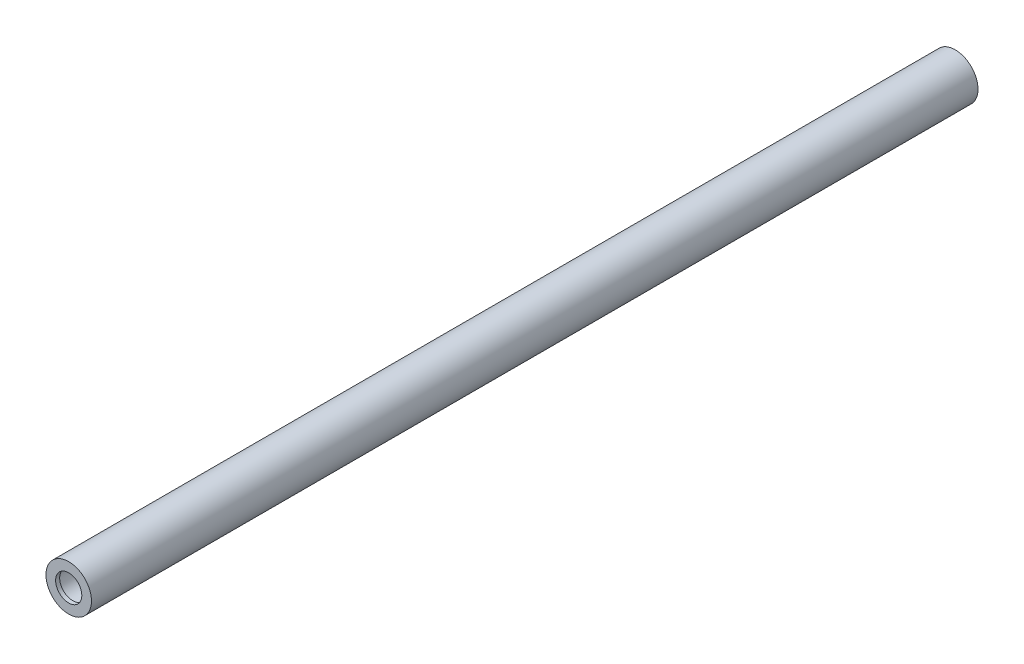
ISO-10303-21;
HEADER;
FILE_DESCRIPTION(('STEP AP214'),'2;1');
FILE_NAME('part.step','',(''),(''),'','','');
FILE_SCHEMA(('AUTOMOTIVE_DESIGN { 1 0 10303 214 1 1 1 1 }'));
ENDSEC;
DATA;
#1=APPLICATION_CONTEXT('core data for automotive mechanical design processes');
#2=APPLICATION_PROTOCOL_DEFINITION('international standard','automotive_design',2000,#1);
#3=PRODUCT_CONTEXT('',#1,'mechanical');
#4=PRODUCT('Part','Part','',(#3));
#5=PRODUCT_RELATED_PRODUCT_CATEGORY('part','',(#4));
#6=PRODUCT_DEFINITION_FORMATION('','',#4);
#7=PRODUCT_DEFINITION_CONTEXT('part definition',#1,'design');
#8=PRODUCT_DEFINITION('design','',#6,#7);
#9=PRODUCT_DEFINITION_SHAPE('','',#8);
#10=(LENGTH_UNIT() NAMED_UNIT(*) SI_UNIT(.MILLI.,.METRE.));
#11=(NAMED_UNIT(*) PLANE_ANGLE_UNIT() SI_UNIT($,.RADIAN.));
#12=(NAMED_UNIT(*) SI_UNIT($,.STERADIAN.) SOLID_ANGLE_UNIT());
#13=UNCERTAINTY_MEASURE_WITH_UNIT(LENGTH_MEASURE(1.E-05),#10,'distance_accuracy_value','');
#14=(GEOMETRIC_REPRESENTATION_CONTEXT(3) GLOBAL_UNCERTAINTY_ASSIGNED_CONTEXT((#13)) GLOBAL_UNIT_ASSIGNED_CONTEXT((#10,
#11,#12)) REPRESENTATION_CONTEXT('',''));
#15=CARTESIAN_POINT('',(0.,0.,0.));
#16=DIRECTION('',(0.,0.,1.));
#17=DIRECTION('',(1.,0.,0.));
#18=AXIS2_PLACEMENT_3D('',#15,#16,#17);
#19=CARTESIAN_POINT('',(0.,0.,440.));
#20=DIRECTION('',(0.,0.,-1.));
#21=DIRECTION('',(-1.,0.,0.));
#22=AXIS2_PLACEMENT_3D('',#19,#20,#21);
#23=CYLINDRICAL_SURFACE('',#22,11.295);
#24=CARTESIAN_POINT('',(0.,0.,440.));
#25=DIRECTION('',(0.,0.,1.));
#26=DIRECTION('',(1.,0.,0.));
#27=AXIS2_PLACEMENT_3D('',#24,#25,#26);
#28=CIRCLE('',#27,11.295);
#29=CARTESIAN_POINT('',(11.295,0.,440.));
#30=VERTEX_POINT('',#29);
#31=EDGE_CURVE('E11',#30,#30,#28,.T.);
#32=ORIENTED_EDGE('',*,*,#31,.F.);
#33=EDGE_LOOP('',(#32));
#34=FACE_BOUND('',#33,.T.);
#35=CARTESIAN_POINT('',(0.,0.,0.));
#36=DIRECTION('',(0.,0.,1.));
#37=DIRECTION('',(1.,0.,0.));
#38=AXIS2_PLACEMENT_3D('',#35,#36,#37);
#39=CIRCLE('',#38,11.295);
#40=CARTESIAN_POINT('',(11.295,0.,0.));
#41=VERTEX_POINT('',#40);
#42=EDGE_CURVE('E43',#41,#41,#39,.T.);
#43=ORIENTED_EDGE('',*,*,#42,.T.);
#44=EDGE_LOOP('',(#43));
#45=FACE_BOUND('',#44,.T.);
#46=ADVANCED_FACE('F40',(#34,#45),#23,.T.);
#47=CARTESIAN_POINT('',(0.,0.,0.));
#48=DIRECTION('',(0.,0.,1.));
#49=DIRECTION('',(1.,0.,0.));
#50=AXIS2_PLACEMENT_3D('',#47,#48,#49);
#51=PLANE('',#50);
#52=CARTESIAN_POINT('',(0.,0.,0.));
#53=DIRECTION('',(0.,0.,-1.));
#54=DIRECTION('',(-1.,0.,0.));
#55=AXIS2_PLACEMENT_3D('',#52,#53,#54);
#56=CIRCLE('',#55,6.5);
#57=CARTESIAN_POINT('',(-6.5,0.,0.));
#58=VERTEX_POINT('',#57);
#59=EDGE_CURVE('E52',#58,#58,#56,.T.);
#60=ORIENTED_EDGE('',*,*,#59,.F.);
#61=EDGE_LOOP('',(#60));
#62=FACE_BOUND('',#61,.T.);
#63=ORIENTED_EDGE('',*,*,#42,.F.);
#64=EDGE_LOOP('',(#63));
#65=FACE_BOUND('',#64,.T.);
#66=ADVANCED_FACE('F104',(#62,#65),#51,.F.);
#67=CARTESIAN_POINT('',(0.,0.,440.));
#68=DIRECTION('',(0.,0.,1.));
#69=DIRECTION('',(1.,0.,0.));
#70=AXIS2_PLACEMENT_3D('',#67,#68,#69);
#71=PLANE('',#70);
#72=CARTESIAN_POINT('',(0.,0.,440.));
#73=DIRECTION('',(0.,0.,1.));
#74=DIRECTION('',(1.,0.,0.));
#75=AXIS2_PLACEMENT_3D('',#72,#73,#74);
#76=CIRCLE('',#75,6.5);
#77=CARTESIAN_POINT('',(6.5,0.,440.));
#78=VERTEX_POINT('',#77);
#79=EDGE_CURVE('E66',#78,#78,#76,.T.);
#80=ORIENTED_EDGE('',*,*,#79,.F.);
#81=EDGE_LOOP('',(#80));
#82=FACE_BOUND('',#81,.T.);
#83=ORIENTED_EDGE('',*,*,#31,.T.);
#84=EDGE_LOOP('',(#83));
#85=FACE_BOUND('',#84,.T.);
#86=ADVANCED_FACE('F109',(#82,#85),#71,.T.);
#87=CARTESIAN_POINT('',(0.,0.,2.));
#88=DIRECTION('',(0.,0.,-1.));
#89=DIRECTION('',(-1.,0.,0.));
#90=AXIS2_PLACEMENT_3D('',#87,#88,#89);
#91=CYLINDRICAL_SURFACE('',#90,6.5);
#92=CARTESIAN_POINT('',(0.,0.,2.));
#93=DIRECTION('',(0.,0.,-1.));
#94=DIRECTION('',(-1.,0.,0.));
#95=AXIS2_PLACEMENT_3D('',#92,#93,#94);
#96=CIRCLE('',#95,6.5);
#97=CARTESIAN_POINT('',(-6.5,0.,2.));
#98=VERTEX_POINT('',#97);
#99=EDGE_CURVE('E57',#98,#98,#96,.T.);
#100=ORIENTED_EDGE('',*,*,#99,.F.);
#101=EDGE_LOOP('',(#100));
#102=FACE_BOUND('',#101,.T.);
#103=ORIENTED_EDGE('',*,*,#59,.T.);
#104=EDGE_LOOP('',(#103));
#105=FACE_BOUND('',#104,.T.);
#106=ADVANCED_FACE('F117',(#102,#105),#91,.F.);
#107=CARTESIAN_POINT('',(0.,0.,17.));
#108=DIRECTION('',(0.,0.,-1.));
#109=DIRECTION('',(-1.,0.,0.));
#110=AXIS2_PLACEMENT_3D('',#107,#108,#109);
#111=CYLINDRICAL_SURFACE('',#110,7.5);
#112=CARTESIAN_POINT('',(0.,0.,17.));
#113=DIRECTION('',(0.,0.,-1.));
#114=DIRECTION('',(-1.,0.,0.));
#115=AXIS2_PLACEMENT_3D('',#112,#113,#114);
#116=CIRCLE('',#115,7.5);
#117=CARTESIAN_POINT('',(-7.5,0.,17.));
#118=VERTEX_POINT('',#117);
#119=EDGE_CURVE('E61',#118,#118,#116,.T.);
#120=ORIENTED_EDGE('',*,*,#119,.F.);
#121=EDGE_LOOP('',(#120));
#122=FACE_BOUND('',#121,.T.);
#123=CARTESIAN_POINT('',(0.,0.,2.));
#124=DIRECTION('',(0.,0.,-1.));
#125=DIRECTION('',(-1.,0.,0.));
#126=AXIS2_PLACEMENT_3D('',#123,#124,#125);
#127=CIRCLE('',#126,7.5);
#128=CARTESIAN_POINT('',(-7.5,0.,2.));
#129=VERTEX_POINT('',#128);
#130=EDGE_CURVE('E62',#129,#129,#127,.T.);
#131=ORIENTED_EDGE('',*,*,#130,.T.);
#132=EDGE_LOOP('',(#131));
#133=FACE_BOUND('',#132,.T.);
#134=ADVANCED_FACE('F124',(#122,#133),#111,.F.);
#135=CARTESIAN_POINT('',(0.,0.,17.));
#136=DIRECTION('',(0.,0.,-1.));
#137=DIRECTION('',(-1.,0.,0.));
#138=AXIS2_PLACEMENT_3D('',#135,#136,#137);
#139=PLANE('',#138);
#140=ORIENTED_EDGE('',*,*,#119,.T.);
#141=EDGE_LOOP('',(#140));
#142=FACE_BOUND('',#141,.T.);
#143=ADVANCED_FACE('F128',(#142),#139,.T.);
#144=CARTESIAN_POINT('',(0.,0.,2.));
#145=DIRECTION('',(0.,0.,-1.));
#146=DIRECTION('',(-1.,0.,0.));
#147=AXIS2_PLACEMENT_3D('',#144,#145,#146);
#148=PLANE('',#147);
#149=ORIENTED_EDGE('',*,*,#99,.T.);
#150=EDGE_LOOP('',(#149));
#151=FACE_BOUND('',#150,.T.);
#152=ORIENTED_EDGE('',*,*,#130,.F.);
#153=EDGE_LOOP('',(#152));
#154=FACE_BOUND('',#153,.T.);
#155=ADVANCED_FACE('F130',(#151,#154),#148,.F.);
#156=CARTESIAN_POINT('',(0.,0.,438.));
#157=DIRECTION('',(0.,0.,1.));
#158=DIRECTION('',(1.,0.,0.));
#159=AXIS2_PLACEMENT_3D('',#156,#157,#158);
#160=CYLINDRICAL_SURFACE('',#159,6.5);
#161=CARTESIAN_POINT('',(0.,0.,438.));
#162=DIRECTION('',(0.,0.,1.));
#163=DIRECTION('',(1.,0.,0.));
#164=AXIS2_PLACEMENT_3D('',#161,#162,#163);
#165=CIRCLE('',#164,6.5);
#166=CARTESIAN_POINT('',(6.5,0.,438.));
#167=VERTEX_POINT('',#166);
#168=EDGE_CURVE('E73',#167,#167,#165,.T.);
#169=ORIENTED_EDGE('',*,*,#168,.F.);
#170=EDGE_LOOP('',(#169));
#171=FACE_BOUND('',#170,.T.);
#172=ORIENTED_EDGE('',*,*,#79,.T.);
#173=EDGE_LOOP('',(#172));
#174=FACE_BOUND('',#173,.T.);
#175=ADVANCED_FACE('F91',(#171,#174),#160,.F.);
#176=CARTESIAN_POINT('',(0.,0.,423.));
#177=DIRECTION('',(0.,0.,1.));
#178=DIRECTION('',(1.,0.,0.));
#179=AXIS2_PLACEMENT_3D('',#176,#177,#178);
#180=CYLINDRICAL_SURFACE('',#179,7.5);
#181=CARTESIAN_POINT('',(0.,0.,423.));
#182=DIRECTION('',(0.,0.,1.));
#183=DIRECTION('',(1.,0.,0.));
#184=AXIS2_PLACEMENT_3D('',#181,#182,#183);
#185=CIRCLE('',#184,7.5);
#186=CARTESIAN_POINT('',(7.5,0.,423.));
#187=VERTEX_POINT('',#186);
#188=EDGE_CURVE('E77',#187,#187,#185,.T.);
#189=ORIENTED_EDGE('',*,*,#188,.F.);
#190=EDGE_LOOP('',(#189));
#191=FACE_BOUND('',#190,.T.);
#192=CARTESIAN_POINT('',(0.,0.,438.));
#193=DIRECTION('',(0.,0.,1.));
#194=DIRECTION('',(1.,0.,0.));
#195=AXIS2_PLACEMENT_3D('',#192,#193,#194);
#196=CIRCLE('',#195,7.5);
#197=CARTESIAN_POINT('',(7.5,0.,438.));
#198=VERTEX_POINT('',#197);
#199=EDGE_CURVE('E78',#198,#198,#196,.T.);
#200=ORIENTED_EDGE('',*,*,#199,.T.);
#201=EDGE_LOOP('',(#200));
#202=FACE_BOUND('',#201,.T.);
#203=ADVANCED_FACE('F88',(#191,#202),#180,.F.);
#204=CARTESIAN_POINT('',(0.,0.,423.));
#205=DIRECTION('',(0.,0.,1.));
#206=DIRECTION('',(1.,0.,0.));
#207=AXIS2_PLACEMENT_3D('',#204,#205,#206);
#208=PLANE('',#207);
#209=ORIENTED_EDGE('',*,*,#188,.T.);
#210=EDGE_LOOP('',(#209));
#211=FACE_BOUND('',#210,.T.);
#212=ADVANCED_FACE('F86',(#211),#208,.T.);
#213=CARTESIAN_POINT('',(0.,0.,438.));
#214=DIRECTION('',(0.,0.,1.));
#215=DIRECTION('',(1.,0.,0.));
#216=AXIS2_PLACEMENT_3D('',#213,#214,#215);
#217=PLANE('',#216);
#218=ORIENTED_EDGE('',*,*,#168,.T.);
#219=EDGE_LOOP('',(#218));
#220=FACE_BOUND('',#219,.T.);
#221=ORIENTED_EDGE('',*,*,#199,.F.);
#222=EDGE_LOOP('',(#221));
#223=FACE_BOUND('',#222,.T.);
#224=ADVANCED_FACE('F95',(#220,#223),#217,.F.);
#225=CLOSED_SHELL('',(#46,#66,#86,#106,#134,#143,#155,#175,#203,#212,#224));
#226=MANIFOLD_SOLID_BREP('B2',#225);
#227=ADVANCED_BREP_SHAPE_REPRESENTATION('',(#18,#226),#14);
#228=SHAPE_DEFINITION_REPRESENTATION(#9,#227);
ENDSEC;
END-ISO-10303-21;
